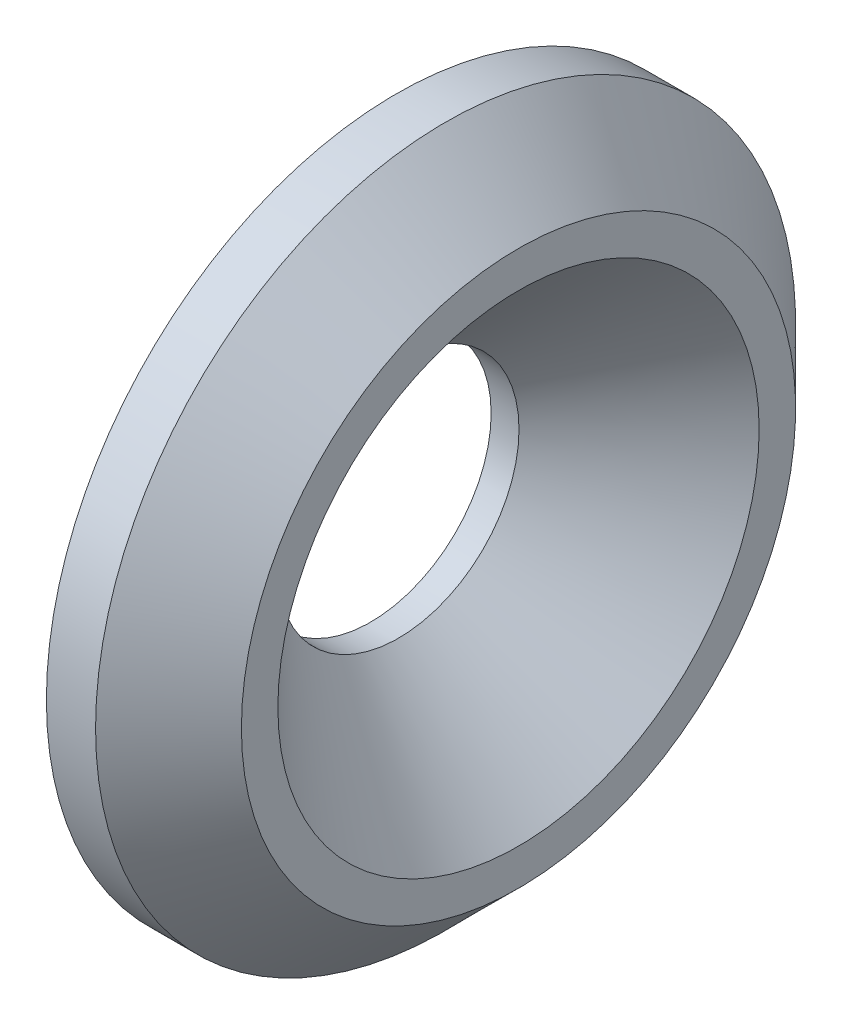
ISO-10303-21;
HEADER;
FILE_DESCRIPTION(('STEP AP214'),'2;1');
FILE_NAME('part.step','',(''),(''),'','','');
FILE_SCHEMA(('AUTOMOTIVE_DESIGN { 1 0 10303 214 1 1 1 1 }'));
ENDSEC;
DATA;
#1=APPLICATION_CONTEXT('core data for automotive mechanical design processes');
#2=APPLICATION_PROTOCOL_DEFINITION('international standard','automotive_design',2000,#1);
#3=PRODUCT_CONTEXT('',#1,'mechanical');
#4=PRODUCT('Part','Part','',(#3));
#5=PRODUCT_RELATED_PRODUCT_CATEGORY('part','',(#4));
#6=PRODUCT_DEFINITION_FORMATION('','',#4);
#7=PRODUCT_DEFINITION_CONTEXT('part definition',#1,'design');
#8=PRODUCT_DEFINITION('design','',#6,#7);
#9=PRODUCT_DEFINITION_SHAPE('','',#8);
#10=(LENGTH_UNIT() NAMED_UNIT(*) SI_UNIT(.MILLI.,.METRE.));
#11=(NAMED_UNIT(*) PLANE_ANGLE_UNIT() SI_UNIT($,.RADIAN.));
#12=(NAMED_UNIT(*) SI_UNIT($,.STERADIAN.) SOLID_ANGLE_UNIT());
#13=UNCERTAINTY_MEASURE_WITH_UNIT(LENGTH_MEASURE(1.E-05),#10,'distance_accuracy_value','');
#14=(GEOMETRIC_REPRESENTATION_CONTEXT(3) GLOBAL_UNCERTAINTY_ASSIGNED_CONTEXT((#13)) GLOBAL_UNIT_ASSIGNED_CONTEXT((#10,
#11,#12)) REPRESENTATION_CONTEXT('',''));
#15=CARTESIAN_POINT('',(0.,0.,0.));
#16=DIRECTION('',(0.,0.,1.));
#17=DIRECTION('',(1.,0.,0.));
#18=AXIS2_PLACEMENT_3D('',#15,#16,#17);
#19=CARTESIAN_POINT('',(443.287790534956,232.41,0.));
#20=DIRECTION('',(-1.,0.,0.));
#21=DIRECTION('',(0.,0.,1.));
#22=AXIS2_PLACEMENT_3D('',#19,#20,#21);
#23=CYLINDRICAL_SURFACE('',#22,12.7);
#24=CARTESIAN_POINT('',(461.353852729726,232.41,0.));
#25=DIRECTION('',(-1.,0.,0.));
#26=DIRECTION('',(0.,0.,1.));
#27=AXIS2_PLACEMENT_3D('',#24,#25,#26);
#28=CIRCLE('',#27,12.7);
#29=CARTESIAN_POINT('',(461.353852729726,232.41,12.7));
#30=VERTEX_POINT('',#29);
#31=EDGE_CURVE('E10',#30,#30,#28,.T.);
#32=ORIENTED_EDGE('',*,*,#31,.F.);
#33=EDGE_LOOP('',(#32));
#34=FACE_BOUND('',#33,.T.);
#35=CARTESIAN_POINT('',(462.478852729726,232.41,0.));
#36=DIRECTION('',(-1.,0.,0.));
#37=DIRECTION('',(0.,0.,1.));
#38=AXIS2_PLACEMENT_3D('',#35,#36,#37);
#39=CIRCLE('',#38,12.7);
#40=CARTESIAN_POINT('',(462.478852729726,232.41,12.7));
#41=VERTEX_POINT('',#40);
#42=EDGE_CURVE('E53',#41,#41,#39,.T.);
#43=ORIENTED_EDGE('',*,*,#42,.T.);
#44=EDGE_LOOP('',(#43));
#45=FACE_BOUND('',#44,.T.);
#46=ADVANCED_FACE('F34',(#34,#45),#23,.T.);
#47=CARTESIAN_POINT('',(461.353852729726,0.,0.));
#48=DIRECTION('',(1.,0.,0.));
#49=DIRECTION('',(0.,0.,-1.));
#50=AXIS2_PLACEMENT_3D('',#47,#48,#49);
#51=PLANE('',#50);
#52=CARTESIAN_POINT('',(461.353852729726,232.41,0.));
#53=DIRECTION('',(1.,0.,0.));
#54=DIRECTION('',(0.,0.,-1.));
#55=AXIS2_PLACEMENT_3D('',#52,#53,#54);
#56=CIRCLE('',#55,5.25);
#57=CARTESIAN_POINT('',(461.353852729726,232.41,-5.25));
#58=VERTEX_POINT('',#57);
#59=EDGE_CURVE('E37',#58,#58,#56,.T.);
#60=ORIENTED_EDGE('',*,*,#59,.T.);
#61=EDGE_LOOP('',(#60));
#62=FACE_BOUND('',#61,.T.);
#63=ORIENTED_EDGE('',*,*,#31,.T.);
#64=EDGE_LOOP('',(#63));
#65=FACE_BOUND('',#64,.T.);
#66=ADVANCED_FACE('F69',(#62,#65),#51,.F.);
#67=CARTESIAN_POINT('',(467.794592233062,0.,0.));
#68=DIRECTION('',(-1.,0.,0.));
#69=DIRECTION('',(0.,0.,1.));
#70=AXIS2_PLACEMENT_3D('',#67,#68,#69);
#71=PLANE('',#70);
#72=CARTESIAN_POINT('',(467.794592233062,232.41,0.));
#73=DIRECTION('',(1.,0.,0.));
#74=DIRECTION('',(0.,0.,-1.));
#75=AXIS2_PLACEMENT_3D('',#72,#73,#74);
#76=CIRCLE('',#75,10.4775);
#77=CARTESIAN_POINT('',(467.794592233062,232.41,-10.4775));
#78=VERTEX_POINT('',#77);
#79=EDGE_CURVE('E59',#78,#78,#76,.T.);
#80=ORIENTED_EDGE('',*,*,#79,.F.);
#81=EDGE_LOOP('',(#80));
#82=FACE_BOUND('',#81,.T.);
#83=CARTESIAN_POINT('',(467.794592233062,232.41,0.));
#84=DIRECTION('',(-1.,0.,0.));
#85=DIRECTION('',(0.,0.,1.));
#86=AXIS2_PLACEMENT_3D('',#83,#84,#85);
#87=CIRCLE('',#86,12.065);
#88=CARTESIAN_POINT('',(467.794592233062,232.41,12.065));
#89=VERTEX_POINT('',#88);
#90=EDGE_CURVE('E41',#89,#89,#87,.T.);
#91=ORIENTED_EDGE('',*,*,#90,.F.);
#92=EDGE_LOOP('',(#91));
#93=FACE_BOUND('',#92,.T.);
#94=ADVANCED_FACE('F65',(#82,#93),#71,.F.);
#95=CARTESIAN_POINT('',(467.794592233062,232.41,0.));
#96=DIRECTION('',(-1.,0.,0.));
#97=DIRECTION('',(0.,0.,1.));
#98=AXIS2_PLACEMENT_3D('',#95,#96,#97);
#99=CONICAL_SURFACE('',#98,12.065,0.785398163397448);
#100=CARTESIAN_POINT('',(464.619592233062,232.41,0.));
#101=DIRECTION('',(-1.,0.,0.));
#102=DIRECTION('',(0.,0.,1.));
#103=AXIS2_PLACEMENT_3D('',#100,#101,#102);
#104=CIRCLE('',#103,15.24);
#105=CARTESIAN_POINT('',(464.619592233062,232.41,15.24));
#106=VERTEX_POINT('',#105);
#107=EDGE_CURVE('E45',#106,#106,#104,.T.);
#108=ORIENTED_EDGE('',*,*,#107,.F.);
#109=EDGE_LOOP('',(#108));
#110=FACE_BOUND('',#109,.T.);
#111=ORIENTED_EDGE('',*,*,#90,.T.);
#112=EDGE_LOOP('',(#111));
#113=FACE_BOUND('',#112,.T.);
#114=ADVANCED_FACE('F68',(#110,#113),#99,.T.);
#115=CARTESIAN_POINT('',(443.287790534956,232.41,0.));
#116=DIRECTION('',(-1.,0.,0.));
#117=DIRECTION('',(0.,0.,1.));
#118=AXIS2_PLACEMENT_3D('',#115,#116,#117);
#119=CYLINDRICAL_SURFACE('',#118,15.24);
#120=CARTESIAN_POINT('',(462.478852729726,232.41,0.));
#121=DIRECTION('',(-1.,0.,0.));
#122=DIRECTION('',(0.,0.,1.));
#123=AXIS2_PLACEMENT_3D('',#120,#121,#122);
#124=CIRCLE('',#123,15.24);
#125=CARTESIAN_POINT('',(462.478852729726,232.41,15.24));
#126=VERTEX_POINT('',#125);
#127=EDGE_CURVE('E50',#126,#126,#124,.T.);
#128=ORIENTED_EDGE('',*,*,#127,.F.);
#129=EDGE_LOOP('',(#128));
#130=FACE_BOUND('',#129,.T.);
#131=ORIENTED_EDGE('',*,*,#107,.T.);
#132=EDGE_LOOP('',(#131));
#133=FACE_BOUND('',#132,.T.);
#134=ADVANCED_FACE('F74',(#130,#133),#119,.T.);
#135=CARTESIAN_POINT('',(462.478852729726,0.,0.));
#136=DIRECTION('',(1.,0.,0.));
#137=DIRECTION('',(0.,0.,-1.));
#138=AXIS2_PLACEMENT_3D('',#135,#136,#137);
#139=PLANE('',#138);
#140=ORIENTED_EDGE('',*,*,#42,.F.);
#141=EDGE_LOOP('',(#140));
#142=FACE_BOUND('',#141,.T.);
#143=ORIENTED_EDGE('',*,*,#127,.T.);
#144=EDGE_LOOP('',(#143));
#145=FACE_BOUND('',#144,.T.);
#146=ADVANCED_FACE('F80',(#142,#145),#139,.F.);
#147=CARTESIAN_POINT('',(467.794592233062,232.41,0.));
#148=DIRECTION('',(1.,0.,0.));
#149=DIRECTION('',(0.,0.,-1.));
#150=AXIS2_PLACEMENT_3D('',#147,#148,#149);
#151=CYLINDRICAL_SURFACE('',#150,5.25);
#152=CARTESIAN_POINT('',(462.567092233062,232.41,0.));
#153=DIRECTION('',(1.,0.,0.));
#154=DIRECTION('',(0.,0.,-1.));
#155=AXIS2_PLACEMENT_3D('',#152,#153,#154);
#156=CIRCLE('',#155,5.25);
#157=CARTESIAN_POINT('',(462.567092233062,232.41,-5.25));
#158=VERTEX_POINT('',#157);
#159=EDGE_CURVE('E56',#158,#158,#156,.T.);
#160=ORIENTED_EDGE('',*,*,#159,.T.);
#161=EDGE_LOOP('',(#160));
#162=FACE_BOUND('',#161,.T.);
#163=ORIENTED_EDGE('',*,*,#59,.F.);
#164=EDGE_LOOP('',(#163));
#165=FACE_BOUND('',#164,.T.);
#166=ADVANCED_FACE('F95',(#162,#165),#151,.F.);
#167=CARTESIAN_POINT('',(467.794592233062,232.41,0.));
#168=DIRECTION('',(1.,0.,0.));
#169=DIRECTION('',(0.,0.,-1.));
#170=AXIS2_PLACEMENT_3D('',#167,#168,#169);
#171=CONICAL_SURFACE('',#170,10.4775,0.785398163397448);
#172=ORIENTED_EDGE('',*,*,#159,.F.);
#173=EDGE_LOOP('',(#172));
#174=FACE_BOUND('',#173,.T.);
#175=ORIENTED_EDGE('',*,*,#79,.T.);
#176=EDGE_LOOP('',(#175));
#177=FACE_BOUND('',#176,.T.);
#178=ADVANCED_FACE('F63',(#174,#177),#171,.F.);
#179=CLOSED_SHELL('',(#46,#66,#94,#114,#134,#146,#166,#178));
#180=MANIFOLD_SOLID_BREP('B2',#179);
#181=ADVANCED_BREP_SHAPE_REPRESENTATION('',(#18,#180),#14);
#182=SHAPE_DEFINITION_REPRESENTATION(#9,#181);
ENDSEC;
END-ISO-10303-21;
